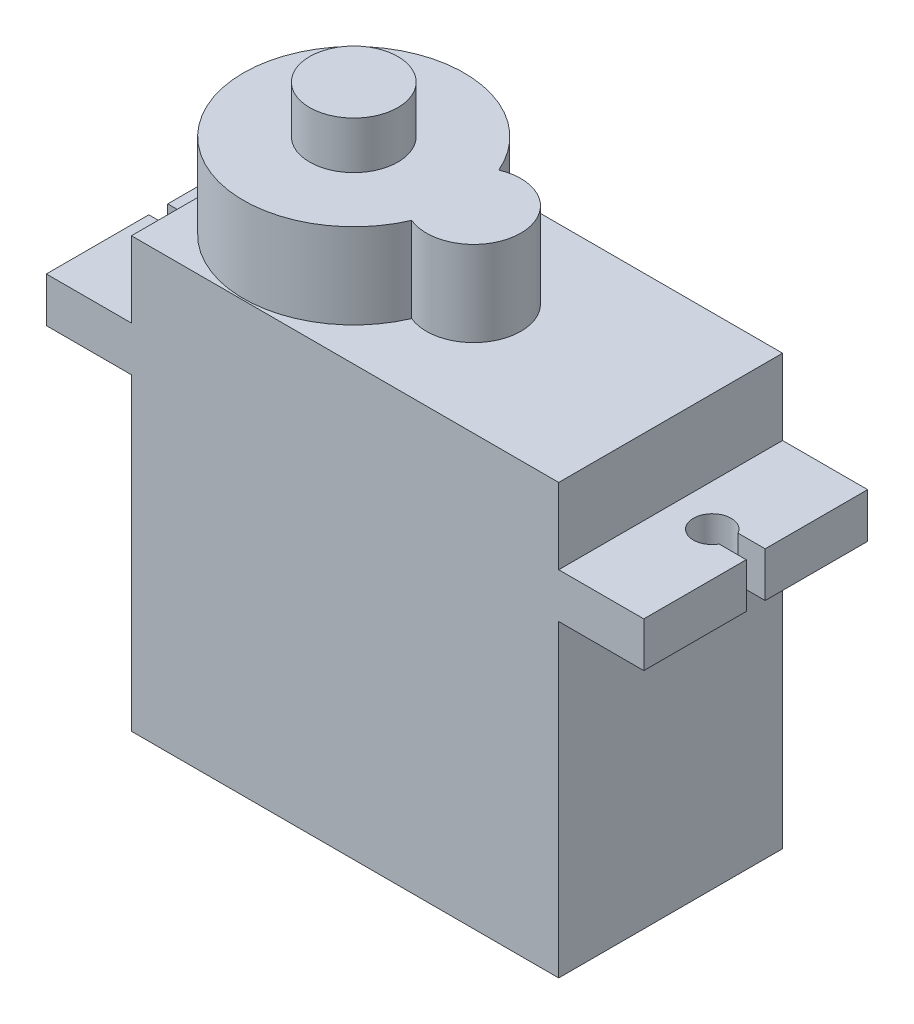
ISO-10303-21;
HEADER;
FILE_DESCRIPTION(('STEP AP214'),'2;1');
FILE_NAME('part.step','',(''),(''),'','','');
FILE_SCHEMA(('AUTOMOTIVE_DESIGN { 1 0 10303 214 1 1 1 1 }'));
ENDSEC;
DATA;
#1=APPLICATION_CONTEXT('core data for automotive mechanical design processes');
#2=APPLICATION_PROTOCOL_DEFINITION('international standard','automotive_design',2000,#1);
#3=PRODUCT_CONTEXT('',#1,'mechanical');
#4=PRODUCT('Part','Part','',(#3));
#5=PRODUCT_RELATED_PRODUCT_CATEGORY('part','',(#4));
#6=PRODUCT_DEFINITION_FORMATION('','',#4);
#7=PRODUCT_DEFINITION_CONTEXT('part definition',#1,'design');
#8=PRODUCT_DEFINITION('design','',#6,#7);
#9=PRODUCT_DEFINITION_SHAPE('','',#8);
#10=(LENGTH_UNIT() NAMED_UNIT(*) SI_UNIT(.MILLI.,.METRE.));
#11=(NAMED_UNIT(*) PLANE_ANGLE_UNIT() SI_UNIT($,.RADIAN.));
#12=(NAMED_UNIT(*) SI_UNIT($,.STERADIAN.) SOLID_ANGLE_UNIT());
#13=UNCERTAINTY_MEASURE_WITH_UNIT(LENGTH_MEASURE(1.E-05),#10,'distance_accuracy_value','');
#14=(GEOMETRIC_REPRESENTATION_CONTEXT(3) GLOBAL_UNCERTAINTY_ASSIGNED_CONTEXT((#13)) GLOBAL_UNIT_ASSIGNED_CONTEXT((#10,
#11,#12)) REPRESENTATION_CONTEXT('',''));
#15=CARTESIAN_POINT('',(0.,0.,0.));
#16=DIRECTION('',(0.,0.,1.));
#17=DIRECTION('',(1.,0.,0.));
#18=AXIS2_PLACEMENT_3D('',#15,#16,#17);
#19=CARTESIAN_POINT('',(-50.695532413833,0.,0.));
#20=DIRECTION('',(-1.,0.,0.));
#21=DIRECTION('',(0.,0.,1.));
#22=AXIS2_PLACEMENT_3D('',#19,#20,#21);
#23=PLANE('',#22);
#24=DIRECTION('',(0.,0.,-1.));
#25=VECTOR('',#24,1.);
#26=CARTESIAN_POINT('',(-50.695532413833,16.33,0.));
#27=LINE('',#26,#25);
#28=CARTESIAN_POINT('',(-50.695532413833,16.33,0.836861805785775));
#29=VERTEX_POINT('',#28);
#30=CARTESIAN_POINT('',(-50.695532413833,16.33,-4.58313819421423));
#31=VERTEX_POINT('',#30);
#32=EDGE_CURVE('E253',#29,#31,#27,.T.);
#33=ORIENTED_EDGE('',*,*,#32,.F.);
#34=DIRECTION('',(0.,1.,0.));
#35=VECTOR('',#34,1.);
#36=CARTESIAN_POINT('',(-50.695532413833,0.,0.836861805785775));
#37=LINE('',#36,#35);
#38=CARTESIAN_POINT('',(-50.695532413833,18.7,0.836861805785775));
#39=VERTEX_POINT('',#38);
#40=EDGE_CURVE('E46',#29,#39,#37,.T.);
#41=ORIENTED_EDGE('',*,*,#40,.T.);
#42=DIRECTION('',(0.,0.,-1.));
#43=VECTOR('',#42,1.);
#44=CARTESIAN_POINT('',(-50.695532413833,18.7,0.));
#45=LINE('',#44,#43);
#46=CARTESIAN_POINT('',(-50.695532413833,18.7,-4.58313819421423));
#47=VERTEX_POINT('',#46);
#48=EDGE_CURVE('E255',#39,#47,#45,.T.);
#49=ORIENTED_EDGE('',*,*,#48,.T.);
#50=DIRECTION('',(0.,-1.,0.));
#51=VECTOR('',#50,1.);
#52=CARTESIAN_POINT('',(-50.695532413833,0.,-4.58313819421423));
#53=LINE('',#52,#51);
#54=EDGE_CURVE('E259',#47,#31,#53,.T.);
#55=ORIENTED_EDGE('',*,*,#54,.T.);
#56=EDGE_LOOP('',(#33,#41,#49,#55));
#57=FACE_BOUND('',#56,.T.);
#58=ADVANCED_FACE('F38',(#57),#23,.T.);
#59=CARTESIAN_POINT('',(-46.195532413833,22.7,-4.58313819421423));
#60=DIRECTION('',(1.,0.,0.));
#61=DIRECTION('',(0.,0.,-1.));
#62=AXIS2_PLACEMENT_3D('',#59,#60,#61);
#63=PLANE('',#62);
#64=DIRECTION('',(0.,0.,-1.));
#65=VECTOR('',#64,1.);
#66=CARTESIAN_POINT('',(-46.195532413833,18.7,0.));
#67=LINE('',#66,#65);
#68=CARTESIAN_POINT('',(-46.195532413833,18.7,7.25686180578577));
#69=VERTEX_POINT('',#68);
#70=CARTESIAN_POINT('',(-46.195532413833,18.7,-4.58313819421423));
#71=VERTEX_POINT('',#70);
#72=EDGE_CURVE('E264',#69,#71,#67,.T.);
#73=ORIENTED_EDGE('',*,*,#72,.F.);
#74=DIRECTION('',(0.,-1.,0.));
#75=VECTOR('',#74,1.);
#76=CARTESIAN_POINT('',(-46.195532413833,22.7,7.25686180578577));
#77=LINE('',#76,#75);
#78=CARTESIAN_POINT('',(-46.195532413833,22.7,7.25686180578577));
#79=VERTEX_POINT('',#78);
#80=EDGE_CURVE('E350',#79,#69,#77,.T.);
#81=ORIENTED_EDGE('',*,*,#80,.F.);
#82=DIRECTION('',(0.,0.,1.));
#83=VECTOR('',#82,1.);
#84=CARTESIAN_POINT('',(-46.195532413833,22.7,-4.58313819421423));
#85=LINE('',#84,#83);
#86=CARTESIAN_POINT('',(-46.195532413833,22.7,1.33686180578577));
#87=VERTEX_POINT('',#86);
#88=EDGE_CURVE('E693',#87,#79,#85,.T.);
#89=ORIENTED_EDGE('',*,*,#88,.F.);
#90=CARTESIAN_POINT('',(-46.195532413833,22.7,-4.58313819421423));
#91=VERTEX_POINT('',#90);
#92=EDGE_CURVE('E723',#91,#87,#85,.T.);
#93=ORIENTED_EDGE('',*,*,#92,.F.);
#94=DIRECTION('',(0.,-1.,0.));
#95=VECTOR('',#94,1.);
#96=CARTESIAN_POINT('',(-46.195532413833,22.7,-4.58313819421423));
#97=LINE('',#96,#95);
#98=EDGE_CURVE('E694',#91,#71,#97,.T.);
#99=ORIENTED_EDGE('',*,*,#98,.T.);
#100=EDGE_LOOP('',(#73,#81,#89,#93,#99));
#101=FACE_BOUND('',#100,.T.);
#102=ADVANCED_FACE('F379',(#101),#63,.F.);
#103=CARTESIAN_POINT('',(-19.095532413833,16.33,0.));
#104=DIRECTION('',(0.,1.,0.));
#105=DIRECTION('',(0.,0.,1.));
#106=AXIS2_PLACEMENT_3D('',#103,#104,#105);
#107=PLANE('',#106);
#108=DIRECTION('',(-1.,0.,0.));
#109=VECTOR('',#108,1.);
#110=CARTESIAN_POINT('',(-19.095532413833,16.33,1.83686180578577));
#111=LINE('',#110,#109);
#112=CARTESIAN_POINT('',(-19.095532413833,16.33,1.83686180578577));
#113=VERTEX_POINT('',#112);
#114=CARTESIAN_POINT('',(-20.5295070100486,16.33,1.83686180578577));
#115=VERTEX_POINT('',#114);
#116=EDGE_CURVE('E293',#113,#115,#111,.T.);
#117=ORIENTED_EDGE('',*,*,#116,.F.);
#118=DIRECTION('',(0.,0.,-1.));
#119=VECTOR('',#118,1.);
#120=CARTESIAN_POINT('',(-19.095532413833,16.33,0.));
#121=LINE('',#120,#119);
#122=CARTESIAN_POINT('',(-19.095532413833,16.33,7.25686180578577));
#123=VERTEX_POINT('',#122);
#124=EDGE_CURVE('E304',#123,#113,#121,.T.);
#125=ORIENTED_EDGE('',*,*,#124,.F.);
#126=DIRECTION('',(-1.,0.,0.));
#127=VECTOR('',#126,1.);
#128=CARTESIAN_POINT('',(-19.095532413833,16.33,7.25686180578577));
#129=LINE('',#128,#127);
#130=CARTESIAN_POINT('',(-23.595532413833,16.33,7.25686180578577));
#131=VERTEX_POINT('',#130);
#132=EDGE_CURVE('E329',#123,#131,#129,.T.);
#133=ORIENTED_EDGE('',*,*,#132,.T.);
#134=DIRECTION('',(0.,0.,-1.));
#135=VECTOR('',#134,1.);
#136=CARTESIAN_POINT('',(-23.595532413833,16.33,0.));
#137=LINE('',#136,#135);
#138=CARTESIAN_POINT('',(-23.595532413833,16.33,-4.58313819421423));
#139=VERTEX_POINT('',#138);
#140=EDGE_CURVE('E298',#131,#139,#137,.T.);
#141=ORIENTED_EDGE('',*,*,#140,.T.);
#142=DIRECTION('',(-1.,0.,0.));
#143=VECTOR('',#142,1.);
#144=CARTESIAN_POINT('',(-19.095532413833,16.33,-4.58313819421423));
#145=LINE('',#144,#143);
#146=CARTESIAN_POINT('',(-19.095532413833,16.33,-4.58313819421423));
#147=VERTEX_POINT('',#146);
#148=EDGE_CURVE('E326',#147,#139,#145,.T.);
#149=ORIENTED_EDGE('',*,*,#148,.F.);
#150=CARTESIAN_POINT('',(-19.095532413833,16.33,0.836861805785775));
#151=VERTEX_POINT('',#150);
#152=EDGE_CURVE('E302',#151,#147,#121,.T.);
#153=ORIENTED_EDGE('',*,*,#152,.F.);
#154=DIRECTION('',(-1.,0.,0.));
#155=VECTOR('',#154,1.);
#156=CARTESIAN_POINT('',(-19.095532413833,16.33,0.836861805785775));
#157=LINE('',#156,#155);
#158=CARTESIAN_POINT('',(-20.5295070100486,16.33,0.836861805785775));
#159=VERTEX_POINT('',#158);
#160=EDGE_CURVE('E289',#151,#159,#157,.T.);
#161=ORIENTED_EDGE('',*,*,#160,.T.);
#162=CARTESIAN_POINT('',(-21.395532413833,16.33,1.33686180578577));
#163=DIRECTION('',(0.,1.,0.));
#164=DIRECTION('',(0.,0.,1.));
#165=AXIS2_PLACEMENT_3D('',#162,#163,#164);
#166=CIRCLE('',#165,1.);
#167=EDGE_CURVE('E295',#159,#115,#166,.T.);
#168=ORIENTED_EDGE('',*,*,#167,.T.);
#169=EDGE_LOOP('',(#117,#125,#133,#141,#149,#153,#161,#168));
#170=FACE_BOUND('',#169,.T.);
#171=ADVANCED_FACE('F385',(#170),#107,.F.);
#172=CARTESIAN_POINT('',(-19.095532413833,18.7,0.));
#173=DIRECTION('',(0.,1.,0.));
#174=DIRECTION('',(0.,0.,1.));
#175=AXIS2_PLACEMENT_3D('',#172,#173,#174);
#176=PLANE('',#175);
#177=DIRECTION('',(0.,0.,-1.));
#178=VECTOR('',#177,1.);
#179=CARTESIAN_POINT('',(-19.095532413833,18.7,0.));
#180=LINE('',#179,#178);
#181=CARTESIAN_POINT('',(-19.095532413833,18.7,7.25686180578577));
#182=VERTEX_POINT('',#181);
#183=CARTESIAN_POINT('',(-19.095532413833,18.7,1.83686180578577));
#184=VERTEX_POINT('',#183);
#185=EDGE_CURVE('E311',#182,#184,#180,.T.);
#186=ORIENTED_EDGE('',*,*,#185,.T.);
#187=DIRECTION('',(-1.,0.,0.));
#188=VECTOR('',#187,1.);
#189=CARTESIAN_POINT('',(0.,18.7,1.83686180578577));
#190=LINE('',#189,#188);
#191=CARTESIAN_POINT('',(-20.5295070100486,18.7,1.83686180578577));
#192=VERTEX_POINT('',#191);
#193=EDGE_CURVE('E283',#184,#192,#190,.T.);
#194=ORIENTED_EDGE('',*,*,#193,.T.);
#195=CARTESIAN_POINT('',(-21.395532413833,18.7,1.33686180578577));
#196=DIRECTION('',(0.,1.,0.));
#197=DIRECTION('',(0.,0.,1.));
#198=AXIS2_PLACEMENT_3D('',#195,#196,#197);
#199=CIRCLE('',#198,1.);
#200=CARTESIAN_POINT('',(-20.5295070100486,18.7,0.836861805785775));
#201=VERTEX_POINT('',#200);
#202=EDGE_CURVE('E280',#201,#192,#199,.T.);
#203=ORIENTED_EDGE('',*,*,#202,.F.);
#204=DIRECTION('',(-1.,0.,0.));
#205=VECTOR('',#204,1.);
#206=CARTESIAN_POINT('',(0.,18.7,0.836861805785775));
#207=LINE('',#206,#205);
#208=CARTESIAN_POINT('',(-19.095532413833,18.7,0.836861805785775));
#209=VERTEX_POINT('',#208);
#210=EDGE_CURVE('E277',#209,#201,#207,.T.);
#211=ORIENTED_EDGE('',*,*,#210,.F.);
#212=CARTESIAN_POINT('',(-19.095532413833,18.7,-4.58313819421423));
#213=VERTEX_POINT('',#212);
#214=EDGE_CURVE('E310',#209,#213,#180,.T.);
#215=ORIENTED_EDGE('',*,*,#214,.T.);
#216=DIRECTION('',(-1.,0.,0.));
#217=VECTOR('',#216,1.);
#218=CARTESIAN_POINT('',(-19.095532413833,18.7,-4.58313819421423));
#219=LINE('',#218,#217);
#220=CARTESIAN_POINT('',(-23.595532413833,18.7,-4.58313819421423));
#221=VERTEX_POINT('',#220);
#222=EDGE_CURVE('E330',#213,#221,#219,.T.);
#223=ORIENTED_EDGE('',*,*,#222,.T.);
#224=DIRECTION('',(0.,0.,-1.));
#225=VECTOR('',#224,1.);
#226=CARTESIAN_POINT('',(-23.595532413833,18.7,0.));
#227=LINE('',#226,#225);
#228=CARTESIAN_POINT('',(-23.595532413833,18.7,7.25686180578577));
#229=VERTEX_POINT('',#228);
#230=EDGE_CURVE('E303',#229,#221,#227,.T.);
#231=ORIENTED_EDGE('',*,*,#230,.F.);
#232=DIRECTION('',(-1.,0.,0.));
#233=VECTOR('',#232,1.);
#234=CARTESIAN_POINT('',(-19.095532413833,18.7,7.25686180578577));
#235=LINE('',#234,#233);
#236=EDGE_CURVE('E314',#182,#229,#235,.T.);
#237=ORIENTED_EDGE('',*,*,#236,.F.);
#238=EDGE_LOOP('',(#186,#194,#203,#211,#215,#223,#231,#237));
#239=FACE_BOUND('',#238,.T.);
#240=ADVANCED_FACE('F551',(#239),#176,.T.);
#241=CARTESIAN_POINT('',(-19.095532413833,0.,0.));
#242=DIRECTION('',(1.,0.,0.));
#243=DIRECTION('',(0.,0.,-1.));
#244=AXIS2_PLACEMENT_3D('',#241,#242,#243);
#245=PLANE('',#244);
#246=ORIENTED_EDGE('',*,*,#124,.T.);
#247=DIRECTION('',(0.,1.,0.));
#248=VECTOR('',#247,1.);
#249=CARTESIAN_POINT('',(-19.095532413833,0.,1.83686180578577));
#250=LINE('',#249,#248);
#251=EDGE_CURVE('E349',#113,#184,#250,.T.);
#252=ORIENTED_EDGE('',*,*,#251,.T.);
#253=ORIENTED_EDGE('',*,*,#185,.F.);
#254=DIRECTION('',(0.,-1.,0.));
#255=VECTOR('',#254,1.);
#256=CARTESIAN_POINT('',(-19.095532413833,0.,7.25686180578577));
#257=LINE('',#256,#255);
#258=EDGE_CURVE('E299',#182,#123,#257,.T.);
#259=ORIENTED_EDGE('',*,*,#258,.T.);
#260=EDGE_LOOP('',(#246,#252,#253,#259));
#261=FACE_BOUND('',#260,.T.);
#262=ADVANCED_FACE('F541',(#261),#245,.T.);
#263=CARTESIAN_POINT('',(-23.595532413833,22.7,-4.58313819421423));
#264=DIRECTION('',(-1.,0.,0.));
#265=DIRECTION('',(0.,0.,1.));
#266=AXIS2_PLACEMENT_3D('',#263,#264,#265);
#267=PLANE('',#266);
#268=ORIENTED_EDGE('',*,*,#140,.F.);
#269=DIRECTION('',(0.,-1.,0.));
#270=VECTOR('',#269,1.);
#271=CARTESIAN_POINT('',(-23.595532413833,22.7,7.25686180578577));
#272=LINE('',#271,#270);
#273=CARTESIAN_POINT('',(-23.595532413833,0.,7.25686180578577));
#274=VERTEX_POINT('',#273);
#275=EDGE_CURVE('E323',#131,#274,#272,.T.);
#276=ORIENTED_EDGE('',*,*,#275,.T.);
#277=DIRECTION('',(0.,0.,-1.));
#278=VECTOR('',#277,1.);
#279=CARTESIAN_POINT('',(-23.595532413833,0.,-4.58313819421423));
#280=LINE('',#279,#278);
#281=CARTESIAN_POINT('',(-23.595532413833,0.,-4.58313819421423));
#282=VERTEX_POINT('',#281);
#283=EDGE_CURVE('E681',#274,#282,#280,.T.);
#284=ORIENTED_EDGE('',*,*,#283,.T.);
#285=DIRECTION('',(0.,-1.,0.));
#286=VECTOR('',#285,1.);
#287=CARTESIAN_POINT('',(-23.595532413833,22.7,-4.58313819421423));
#288=LINE('',#287,#286);
#289=EDGE_CURVE('E696',#139,#282,#288,.T.);
#290=ORIENTED_EDGE('',*,*,#289,.F.);
#291=EDGE_LOOP('',(#268,#276,#284,#290));
#292=FACE_BOUND('',#291,.T.);
#293=ADVANCED_FACE('F550',(#292),#267,.F.);
#294=CARTESIAN_POINT('',(-46.195532413833,22.7,7.25686180578577));
#295=DIRECTION('',(0.,1.,0.));
#296=DIRECTION('',(0.,0.,1.));
#297=AXIS2_PLACEMENT_3D('',#294,#295,#296);
#298=PLANE('',#297);
#299=CARTESIAN_POINT('',(-40.355532413833,22.7,1.33686180578577));
#300=DIRECTION('',(0.,1.,0.));
#301=DIRECTION('',(0.,0.,1.));
#302=AXIS2_PLACEMENT_3D('',#299,#300,#301);
#303=CIRCLE('',#302,5.84);
#304=CARTESIAN_POINT('',(-34.9887185337068,22.7,-0.965942739998552));
#305=VERTEX_POINT('',#304);
#306=EDGE_CURVE('E728',#305,#87,#303,.T.);
#307=ORIENTED_EDGE('',*,*,#306,.F.);
#308=CARTESIAN_POINT('',(-34.015532413833,22.7,1.33686180578577));
#309=DIRECTION('',(0.,1.,0.));
#310=DIRECTION('',(0.,0.,1.));
#311=AXIS2_PLACEMENT_3D('',#308,#309,#310);
#312=CIRCLE('',#311,2.5);
#313=CARTESIAN_POINT('',(-34.9887185337068,22.7,3.6396663515701));
#314=VERTEX_POINT('',#313);
#315=EDGE_CURVE('E335',#314,#305,#312,.T.);
#316=ORIENTED_EDGE('',*,*,#315,.F.);
#317=EDGE_CURVE('E684',#87,#314,#303,.T.);
#318=ORIENTED_EDGE('',*,*,#317,.F.);
#319=ORIENTED_EDGE('',*,*,#88,.T.);
#320=DIRECTION('',(1.,0.,0.));
#321=VECTOR('',#320,1.);
#322=CARTESIAN_POINT('',(-46.195532413833,22.7,7.25686180578577));
#323=LINE('',#322,#321);
#324=CARTESIAN_POINT('',(-23.595532413833,22.7,7.25686180578577));
#325=VERTEX_POINT('',#324);
#326=EDGE_CURVE('E722',#79,#325,#323,.T.);
#327=ORIENTED_EDGE('',*,*,#326,.T.);
#328=DIRECTION('',(0.,0.,-1.));
#329=VECTOR('',#328,1.);
#330=CARTESIAN_POINT('',(-23.595532413833,22.7,-4.58313819421423));
#331=LINE('',#330,#329);
#332=CARTESIAN_POINT('',(-23.595532413833,22.7,-4.58313819421423));
#333=VERTEX_POINT('',#332);
#334=EDGE_CURVE('E721',#325,#333,#331,.T.);
#335=ORIENTED_EDGE('',*,*,#334,.T.);
#336=DIRECTION('',(-1.,0.,0.));
#337=VECTOR('',#336,1.);
#338=CARTESIAN_POINT('',(-46.195532413833,22.7,-4.58313819421423));
#339=LINE('',#338,#337);
#340=EDGE_CURVE('E687',#333,#91,#339,.T.);
#341=ORIENTED_EDGE('',*,*,#340,.T.);
#342=ORIENTED_EDGE('',*,*,#92,.T.);
#343=EDGE_LOOP('',(#307,#316,#318,#319,#327,#335,#341,#342));
#344=FACE_BOUND('',#343,.T.);
#345=ADVANCED_FACE('F585',(#344),#298,.T.);
#346=CARTESIAN_POINT('',(-40.355532413833,27.2,1.33686180578577));
#347=DIRECTION('',(0.,-1.,0.));
#348=DIRECTION('',(0.,0.,-1.));
#349=AXIS2_PLACEMENT_3D('',#346,#347,#348);
#350=CYLINDRICAL_SURFACE('',#349,5.84);
#351=DIRECTION('',(0.,-1.,0.));
#352=VECTOR('',#351,1.);
#353=CARTESIAN_POINT('',(-34.9887185337068,27.2,3.6396663515701));
#354=LINE('',#353,#352);
#355=CARTESIAN_POINT('',(-34.9887185337068,27.2,3.6396663515701));
#356=VERTEX_POINT('',#355);
#357=EDGE_CURVE('E734',#356,#314,#354,.T.);
#358=ORIENTED_EDGE('',*,*,#357,.F.);
#359=CARTESIAN_POINT('',(-40.355532413833,27.2,1.33686180578577));
#360=DIRECTION('',(0.,1.,0.));
#361=DIRECTION('',(0.,0.,1.));
#362=AXIS2_PLACEMENT_3D('',#359,#360,#361);
#363=CIRCLE('',#362,5.84);
#364=CARTESIAN_POINT('',(-34.9887185337068,27.2,-0.965942739998555));
#365=VERTEX_POINT('',#364);
#366=EDGE_CURVE('E679',#365,#356,#363,.T.);
#367=ORIENTED_EDGE('',*,*,#366,.F.);
#368=DIRECTION('',(0.,-1.,0.));
#369=VECTOR('',#368,1.);
#370=CARTESIAN_POINT('',(-34.9887185337068,27.2,-0.965942739998552));
#371=LINE('',#370,#369);
#372=EDGE_CURVE('E738',#365,#305,#371,.T.);
#373=ORIENTED_EDGE('',*,*,#372,.T.);
#374=ORIENTED_EDGE('',*,*,#306,.T.);
#375=ORIENTED_EDGE('',*,*,#317,.T.);
#376=EDGE_LOOP('',(#358,#367,#373,#374,#375));
#377=FACE_BOUND('',#376,.T.);
#378=ADVANCED_FACE('F605',(#377),#350,.T.);
#379=CARTESIAN_POINT('',(0.,27.2,0.));
#380=DIRECTION('',(0.,1.,0.));
#381=DIRECTION('',(0.,0.,1.));
#382=AXIS2_PLACEMENT_3D('',#379,#380,#381);
#383=PLANE('',#382);
#384=ORIENTED_EDGE('',*,*,#366,.T.);
#385=CARTESIAN_POINT('',(-34.015532413833,27.2,1.33686180578577));
#386=DIRECTION('',(0.,1.,0.));
#387=DIRECTION('',(0.,0.,1.));
#388=AXIS2_PLACEMENT_3D('',#385,#386,#387);
#389=CIRCLE('',#388,2.5);
#390=EDGE_CURVE('E741',#356,#365,#389,.T.);
#391=ORIENTED_EDGE('',*,*,#390,.T.);
#392=EDGE_LOOP('',(#384,#391));
#393=FACE_BOUND('',#392,.T.);
#394=CARTESIAN_POINT('',(-40.355532413833,27.2,1.33686180578577));
#395=DIRECTION('',(0.,1.,0.));
#396=DIRECTION('',(0.,0.,1.));
#397=AXIS2_PLACEMENT_3D('',#394,#395,#396);
#398=CIRCLE('',#397,2.335);
#399=CARTESIAN_POINT('',(-40.355532413833,27.2,3.67186180578577));
#400=VERTEX_POINT('',#399);
#401=EDGE_CURVE('E730',#400,#400,#398,.T.);
#402=ORIENTED_EDGE('',*,*,#401,.F.);
#403=EDGE_LOOP('',(#402));
#404=FACE_BOUND('',#403,.T.);
#405=ADVANCED_FACE('F492',(#393,#404),#383,.T.);
#406=CARTESIAN_POINT('',(-46.195532413833,16.33,7.25686180578577));
#407=VERTEX_POINT('',#406);
#408=CARTESIAN_POINT('',(-46.195532413833,0.,7.25686180578577));
#409=VERTEX_POINT('',#408);
#410=EDGE_CURVE('E61',#407,#409,#77,.T.);
#411=ORIENTED_EDGE('',*,*,#410,.F.);
#412=DIRECTION('',(0.,0.,-1.));
#413=VECTOR('',#412,1.);
#414=CARTESIAN_POINT('',(-46.195532413833,16.33,0.));
#415=LINE('',#414,#413);
#416=CARTESIAN_POINT('',(-46.195532413833,16.33,-4.58313819421423));
#417=VERTEX_POINT('',#416);
#418=EDGE_CURVE('E248',#407,#417,#415,.T.);
#419=ORIENTED_EDGE('',*,*,#418,.T.);
#420=CARTESIAN_POINT('',(-46.195532413833,0.,-4.58313819421423));
#421=VERTEX_POINT('',#420);
#422=EDGE_CURVE('E361',#417,#421,#97,.T.);
#423=ORIENTED_EDGE('',*,*,#422,.T.);
#424=DIRECTION('',(0.,0.,1.));
#425=VECTOR('',#424,1.);
#426=CARTESIAN_POINT('',(-46.195532413833,0.,-4.58313819421423));
#427=LINE('',#426,#425);
#428=EDGE_CURVE('E675',#421,#409,#427,.T.);
#429=ORIENTED_EDGE('',*,*,#428,.T.);
#430=EDGE_LOOP('',(#411,#419,#423,#429));
#431=FACE_BOUND('',#430,.T.);
#432=ADVANCED_FACE('F40',(#431),#63,.F.);
#433=CARTESIAN_POINT('',(-46.195532413833,22.7,7.25686180578577));
#434=DIRECTION('',(0.,0.,-1.));
#435=DIRECTION('',(-1.,0.,0.));
#436=AXIS2_PLACEMENT_3D('',#433,#434,#435);
#437=PLANE('',#436);
#438=DIRECTION('',(1.,0.,0.));
#439=VECTOR('',#438,1.);
#440=CARTESIAN_POINT('',(-46.195532413833,0.,7.25686180578577));
#441=LINE('',#440,#439);
#442=EDGE_CURVE('E678',#409,#274,#441,.T.);
#443=ORIENTED_EDGE('',*,*,#442,.T.);
#444=ORIENTED_EDGE('',*,*,#275,.F.);
#445=ORIENTED_EDGE('',*,*,#132,.F.);
#446=ORIENTED_EDGE('',*,*,#258,.F.);
#447=ORIENTED_EDGE('',*,*,#236,.T.);
#448=EDGE_CURVE('E705',#325,#229,#272,.T.);
#449=ORIENTED_EDGE('',*,*,#448,.F.);
#450=ORIENTED_EDGE('',*,*,#326,.F.);
#451=ORIENTED_EDGE('',*,*,#80,.T.);
#452=DIRECTION('',(1.,0.,0.));
#453=VECTOR('',#452,1.);
#454=CARTESIAN_POINT('',(-50.695532413833,18.7,7.25686180578577));
#455=LINE('',#454,#453);
#456=CARTESIAN_POINT('',(-50.695532413833,18.7,7.25686180578577));
#457=VERTEX_POINT('',#456);
#458=EDGE_CURVE('E272',#457,#69,#455,.T.);
#459=ORIENTED_EDGE('',*,*,#458,.F.);
#460=DIRECTION('',(0.,1.,0.));
#461=VECTOR('',#460,1.);
#462=CARTESIAN_POINT('',(-50.695532413833,0.,7.25686180578577));
#463=LINE('',#462,#461);
#464=CARTESIAN_POINT('',(-50.695532413833,16.33,7.25686180578577));
#465=VERTEX_POINT('',#464);
#466=EDGE_CURVE('E252',#465,#457,#463,.T.);
#467=ORIENTED_EDGE('',*,*,#466,.F.);
#468=DIRECTION('',(1.,0.,0.));
#469=VECTOR('',#468,1.);
#470=CARTESIAN_POINT('',(-50.695532413833,16.33,7.25686180578577));
#471=LINE('',#470,#469);
#472=EDGE_CURVE('E275',#465,#407,#471,.T.);
#473=ORIENTED_EDGE('',*,*,#472,.T.);
#474=ORIENTED_EDGE('',*,*,#410,.T.);
#475=EDGE_LOOP('',(#443,#444,#445,#446,#447,#449,#450,#451,#459,#467,#473,#474));
#476=FACE_BOUND('',#475,.T.);
#477=ADVANCED_FACE('F403',(#476),#437,.F.);
#478=ORIENTED_EDGE('',*,*,#448,.T.);
#479=ORIENTED_EDGE('',*,*,#230,.T.);
#480=EDGE_CURVE('E703',#333,#221,#288,.T.);
#481=ORIENTED_EDGE('',*,*,#480,.F.);
#482=ORIENTED_EDGE('',*,*,#334,.F.);
#483=EDGE_LOOP('',(#478,#479,#481,#482));
#484=FACE_BOUND('',#483,.T.);
#485=ADVANCED_FACE('F468',(#484),#267,.F.);
#486=CARTESIAN_POINT('',(-46.195532413833,22.7,-4.58313819421423));
#487=DIRECTION('',(0.,0.,1.));
#488=DIRECTION('',(1.,0.,0.));
#489=AXIS2_PLACEMENT_3D('',#486,#487,#488);
#490=PLANE('',#489);
#491=DIRECTION('',(-1.,0.,0.));
#492=VECTOR('',#491,1.);
#493=CARTESIAN_POINT('',(-46.195532413833,0.,-4.58313819421423));
#494=LINE('',#493,#492);
#495=EDGE_CURVE('E677',#282,#421,#494,.T.);
#496=ORIENTED_EDGE('',*,*,#495,.T.);
#497=ORIENTED_EDGE('',*,*,#422,.F.);
#498=DIRECTION('',(1.,0.,0.));
#499=VECTOR('',#498,1.);
#500=CARTESIAN_POINT('',(-50.695532413833,16.33,-4.58313819421423));
#501=LINE('',#500,#499);
#502=EDGE_CURVE('E262',#31,#417,#501,.T.);
#503=ORIENTED_EDGE('',*,*,#502,.F.);
#504=ORIENTED_EDGE('',*,*,#54,.F.);
#505=DIRECTION('',(1.,0.,0.));
#506=VECTOR('',#505,1.);
#507=CARTESIAN_POINT('',(-50.695532413833,18.7,-4.58313819421423));
#508=LINE('',#507,#506);
#509=EDGE_CURVE('E269',#47,#71,#508,.T.);
#510=ORIENTED_EDGE('',*,*,#509,.T.);
#511=ORIENTED_EDGE('',*,*,#98,.F.);
#512=ORIENTED_EDGE('',*,*,#340,.F.);
#513=ORIENTED_EDGE('',*,*,#480,.T.);
#514=ORIENTED_EDGE('',*,*,#222,.F.);
#515=DIRECTION('',(0.,1.,0.));
#516=VECTOR('',#515,1.);
#517=CARTESIAN_POINT('',(-19.095532413833,0.,-4.58313819421423));
#518=LINE('',#517,#516);
#519=EDGE_CURVE('E307',#147,#213,#518,.T.);
#520=ORIENTED_EDGE('',*,*,#519,.F.);
#521=ORIENTED_EDGE('',*,*,#148,.T.);
#522=ORIENTED_EDGE('',*,*,#289,.T.);
#523=EDGE_LOOP('',(#496,#497,#503,#504,#510,#511,#512,#513,#514,#520,#521,#522));
#524=FACE_BOUND('',#523,.T.);
#525=ADVANCED_FACE('F360',(#524),#490,.F.);
#526=CARTESIAN_POINT('',(-46.195532413833,0.,7.25686180578577));
#527=DIRECTION('',(0.,1.,0.));
#528=DIRECTION('',(0.,0.,1.));
#529=AXIS2_PLACEMENT_3D('',#526,#527,#528);
#530=PLANE('',#529);
#531=ORIENTED_EDGE('',*,*,#428,.F.);
#532=ORIENTED_EDGE('',*,*,#495,.F.);
#533=ORIENTED_EDGE('',*,*,#283,.F.);
#534=ORIENTED_EDGE('',*,*,#442,.F.);
#535=EDGE_LOOP('',(#531,#532,#533,#534));
#536=FACE_BOUND('',#535,.T.);
#537=ADVANCED_FACE('F467',(#536),#530,.F.);
#538=CARTESIAN_POINT('',(-40.355532413833,29.7,1.33686180578577));
#539=DIRECTION('',(0.,-1.,0.));
#540=DIRECTION('',(0.,0.,-1.));
#541=AXIS2_PLACEMENT_3D('',#538,#539,#540);
#542=CYLINDRICAL_SURFACE('',#541,2.335);
#543=CARTESIAN_POINT('',(-40.355532413833,29.7,1.33686180578577));
#544=DIRECTION('',(0.,1.,0.));
#545=DIRECTION('',(0.,0.,1.));
#546=AXIS2_PLACEMENT_3D('',#543,#544,#545);
#547=CIRCLE('',#546,2.335);
#548=CARTESIAN_POINT('',(-40.355532413833,29.7,3.67186180578577));
#549=VERTEX_POINT('',#548);
#550=EDGE_CURVE('E733',#549,#549,#547,.T.);
#551=ORIENTED_EDGE('',*,*,#550,.F.);
#552=EDGE_LOOP('',(#551));
#553=FACE_BOUND('',#552,.T.);
#554=ORIENTED_EDGE('',*,*,#401,.T.);
#555=EDGE_LOOP('',(#554));
#556=FACE_BOUND('',#555,.T.);
#557=ADVANCED_FACE('F633',(#553,#556),#542,.T.);
#558=CARTESIAN_POINT('',(-40.355532413833,29.7,1.33686180578577));
#559=DIRECTION('',(0.,1.,0.));
#560=DIRECTION('',(0.,0.,1.));
#561=AXIS2_PLACEMENT_3D('',#558,#559,#560);
#562=PLANE('',#561);
#563=ORIENTED_EDGE('',*,*,#550,.T.);
#564=EDGE_LOOP('',(#563));
#565=FACE_BOUND('',#564,.T.);
#566=ADVANCED_FACE('F595',(#565),#562,.T.);
#567=CARTESIAN_POINT('',(-34.015532413833,27.2,1.33686180578577));
#568=DIRECTION('',(0.,-1.,0.));
#569=DIRECTION('',(0.,0.,-1.));
#570=AXIS2_PLACEMENT_3D('',#567,#568,#569);
#571=CYLINDRICAL_SURFACE('',#570,2.5);
#572=ORIENTED_EDGE('',*,*,#315,.T.);
#573=ORIENTED_EDGE('',*,*,#372,.F.);
#574=ORIENTED_EDGE('',*,*,#390,.F.);
#575=ORIENTED_EDGE('',*,*,#357,.T.);
#576=EDGE_LOOP('',(#572,#573,#574,#575));
#577=FACE_BOUND('',#576,.T.);
#578=ADVANCED_FACE('F538',(#577),#571,.T.);
#579=DIRECTION('',(0.,1.,0.));
#580=VECTOR('',#579,1.);
#581=CARTESIAN_POINT('',(-19.095532413833,0.,0.836861805785775));
#582=LINE('',#581,#580);
#583=EDGE_CURVE('E347',#151,#209,#582,.T.);
#584=ORIENTED_EDGE('',*,*,#583,.F.);
#585=ORIENTED_EDGE('',*,*,#152,.T.);
#586=ORIENTED_EDGE('',*,*,#519,.T.);
#587=ORIENTED_EDGE('',*,*,#214,.F.);
#588=EDGE_LOOP('',(#584,#585,#586,#587));
#589=FACE_BOUND('',#588,.T.);
#590=ADVANCED_FACE('F528',(#589),#245,.T.);
#591=CARTESIAN_POINT('',(-21.395532413833,-2.50000000007189E-05,1.33686180578577));
#592=DIRECTION('',(0.,1.,0.));
#593=DIRECTION('',(0.,0.,1.));
#594=AXIS2_PLACEMENT_3D('',#591,#592,#593);
#595=CYLINDRICAL_SURFACE('',#594,1.);
#596=DIRECTION('',(0.,1.,0.));
#597=VECTOR('',#596,1.);
#598=CARTESIAN_POINT('',(-20.5295070100486,-2.50000000007189E-05,0.836861805785775));
#599=LINE('',#598,#597);
#600=EDGE_CURVE('E286',#159,#201,#599,.T.);
#601=ORIENTED_EDGE('',*,*,#600,.T.);
#602=ORIENTED_EDGE('',*,*,#202,.T.);
#603=DIRECTION('',(0.,1.,0.));
#604=VECTOR('',#603,1.);
#605=CARTESIAN_POINT('',(-20.5295070100486,-2.50000000007189E-05,1.83686180578577));
#606=LINE('',#605,#604);
#607=EDGE_CURVE('E287',#115,#192,#606,.T.);
#608=ORIENTED_EDGE('',*,*,#607,.F.);
#609=ORIENTED_EDGE('',*,*,#167,.F.);
#610=EDGE_LOOP('',(#601,#602,#608,#609));
#611=FACE_BOUND('',#610,.T.);
#612=ADVANCED_FACE('F518',(#611),#595,.F.);
#613=CARTESIAN_POINT('',(0.,-2.50000000007189E-05,1.83686180578577));
#614=DIRECTION('',(0.,0.,-1.));
#615=DIRECTION('',(-1.,0.,0.));
#616=AXIS2_PLACEMENT_3D('',#613,#614,#615);
#617=PLANE('',#616);
#618=ORIENTED_EDGE('',*,*,#116,.T.);
#619=ORIENTED_EDGE('',*,*,#607,.T.);
#620=ORIENTED_EDGE('',*,*,#193,.F.);
#621=ORIENTED_EDGE('',*,*,#251,.F.);
#622=EDGE_LOOP('',(#618,#619,#620,#621));
#623=FACE_BOUND('',#622,.T.);
#624=ADVANCED_FACE('F508',(#623),#617,.T.);
#625=CARTESIAN_POINT('',(0.,-2.50000000007189E-05,0.836861805785775));
#626=DIRECTION('',(0.,0.,-1.));
#627=DIRECTION('',(-1.,0.,0.));
#628=AXIS2_PLACEMENT_3D('',#625,#626,#627);
#629=PLANE('',#628);
#630=ORIENTED_EDGE('',*,*,#583,.T.);
#631=ORIENTED_EDGE('',*,*,#210,.T.);
#632=ORIENTED_EDGE('',*,*,#600,.F.);
#633=ORIENTED_EDGE('',*,*,#160,.F.);
#634=EDGE_LOOP('',(#630,#631,#632,#633));
#635=FACE_BOUND('',#634,.T.);
#636=ADVANCED_FACE('F459',(#635),#629,.F.);
#637=CARTESIAN_POINT('',(-50.695532413833,16.33,0.));
#638=DIRECTION('',(0.,-1.,0.));
#639=DIRECTION('',(0.,0.,-1.));
#640=AXIS2_PLACEMENT_3D('',#637,#638,#639);
#641=PLANE('',#640);
#642=DIRECTION('',(-1.,0.,0.));
#643=VECTOR('',#642,1.);
#644=CARTESIAN_POINT('',(-50.695532413833,16.33,1.83686180578577));
#645=LINE('',#644,#643);
#646=CARTESIAN_POINT('',(-49.195532413833,16.33,1.83686180578577));
#647=VERTEX_POINT('',#646);
#648=CARTESIAN_POINT('',(-50.695532413833,16.33,1.83686180578577));
#649=VERTEX_POINT('',#648);
#650=EDGE_CURVE('E240',#647,#649,#645,.T.);
#651=ORIENTED_EDGE('',*,*,#650,.F.);
#652=DIRECTION('',(0.,0.,-1.));
#653=VECTOR('',#652,1.);
#654=CARTESIAN_POINT('',(-49.195532413833,16.33,0.));
#655=LINE('',#654,#653);
#656=CARTESIAN_POINT('',(-49.195532413833,16.33,1.77275170013984));
#657=VERTEX_POINT('',#656);
#658=EDGE_CURVE('E243',#647,#657,#655,.T.);
#659=ORIENTED_EDGE('',*,*,#658,.T.);
#660=CARTESIAN_POINT('',(-48.295532413833,16.33,1.33686180578577));
#661=DIRECTION('',(0.,-1.,0.));
#662=DIRECTION('',(0.,0.,-1.));
#663=AXIS2_PLACEMENT_3D('',#660,#661,#662);
#664=CIRCLE('',#663,0.999999999999998);
#665=CARTESIAN_POINT('',(-49.195532413833,16.33,0.900971911431708));
#666=VERTEX_POINT('',#665);
#667=EDGE_CURVE('E246',#666,#657,#664,.T.);
#668=ORIENTED_EDGE('',*,*,#667,.F.);
#669=DIRECTION('',(0.,0.,-1.));
#670=VECTOR('',#669,1.);
#671=CARTESIAN_POINT('',(-49.195532413833,16.33,0.));
#672=LINE('',#671,#670);
#673=CARTESIAN_POINT('',(-49.195532413833,16.33,0.836861805785774));
#674=VERTEX_POINT('',#673);
#675=EDGE_CURVE('E209',#666,#674,#672,.T.);
#676=ORIENTED_EDGE('',*,*,#675,.T.);
#677=DIRECTION('',(-1.,0.,0.));
#678=VECTOR('',#677,1.);
#679=CARTESIAN_POINT('',(-50.695532413833,16.33,0.836861805785775));
#680=LINE('',#679,#678);
#681=EDGE_CURVE('E234',#674,#29,#680,.T.);
#682=ORIENTED_EDGE('',*,*,#681,.T.);
#683=ORIENTED_EDGE('',*,*,#32,.T.);
#684=ORIENTED_EDGE('',*,*,#502,.T.);
#685=ORIENTED_EDGE('',*,*,#418,.F.);
#686=ORIENTED_EDGE('',*,*,#472,.F.);
#687=EDGE_CURVE('E249',#465,#649,#27,.T.);
#688=ORIENTED_EDGE('',*,*,#687,.T.);
#689=EDGE_LOOP('',(#651,#659,#668,#676,#682,#683,#684,#685,#686,#688));
#690=FACE_BOUND('',#689,.T.);
#691=ADVANCED_FACE('F365',(#690),#641,.T.);
#692=CARTESIAN_POINT('',(-50.695532413833,18.7,0.));
#693=DIRECTION('',(0.,-1.,0.));
#694=DIRECTION('',(0.,0.,-1.));
#695=AXIS2_PLACEMENT_3D('',#692,#693,#694);
#696=PLANE('',#695);
#697=DIRECTION('',(0.,0.,1.));
#698=VECTOR('',#697,1.);
#699=CARTESIAN_POINT('',(-49.195532413833,18.7,0.));
#700=LINE('',#699,#698);
#701=CARTESIAN_POINT('',(-49.195532413833,18.7,1.77275170013984));
#702=VERTEX_POINT('',#701);
#703=CARTESIAN_POINT('',(-49.195532413833,18.7,1.83686180578577));
#704=VERTEX_POINT('',#703);
#705=EDGE_CURVE('E213',#702,#704,#700,.T.);
#706=ORIENTED_EDGE('',*,*,#705,.T.);
#707=DIRECTION('',(1.,0.,0.));
#708=VECTOR('',#707,1.);
#709=CARTESIAN_POINT('',(0.,18.7,1.83686180578576));
#710=LINE('',#709,#708);
#711=CARTESIAN_POINT('',(-50.695532413833,18.7,1.83686180578577));
#712=VERTEX_POINT('',#711);
#713=EDGE_CURVE('E227',#712,#704,#710,.T.);
#714=ORIENTED_EDGE('',*,*,#713,.F.);
#715=EDGE_CURVE('E256',#457,#712,#45,.T.);
#716=ORIENTED_EDGE('',*,*,#715,.F.);
#717=ORIENTED_EDGE('',*,*,#458,.T.);
#718=ORIENTED_EDGE('',*,*,#72,.T.);
#719=ORIENTED_EDGE('',*,*,#509,.F.);
#720=ORIENTED_EDGE('',*,*,#48,.F.);
#721=DIRECTION('',(1.,0.,0.));
#722=VECTOR('',#721,1.);
#723=CARTESIAN_POINT('',(0.,18.7,0.83686180578576));
#724=LINE('',#723,#722);
#725=CARTESIAN_POINT('',(-49.195532413833,18.7,0.836861805785774));
#726=VERTEX_POINT('',#725);
#727=EDGE_CURVE('E53',#39,#726,#724,.T.);
#728=ORIENTED_EDGE('',*,*,#727,.T.);
#729=DIRECTION('',(0.,0.,1.));
#730=VECTOR('',#729,1.);
#731=CARTESIAN_POINT('',(-49.195532413833,18.7,0.));
#732=LINE('',#731,#730);
#733=CARTESIAN_POINT('',(-49.195532413833,18.7,0.900971911431708));
#734=VERTEX_POINT('',#733);
#735=EDGE_CURVE('E207',#726,#734,#732,.T.);
#736=ORIENTED_EDGE('',*,*,#735,.T.);
#737=CARTESIAN_POINT('',(-48.295532413833,18.7,1.33686180578577));
#738=DIRECTION('',(0.,1.,0.));
#739=DIRECTION('',(0.,0.,1.));
#740=AXIS2_PLACEMENT_3D('',#737,#738,#739);
#741=CIRCLE('',#740,0.999999999999998);
#742=EDGE_CURVE('E216',#702,#734,#741,.T.);
#743=ORIENTED_EDGE('',*,*,#742,.F.);
#744=EDGE_LOOP('',(#706,#714,#716,#717,#718,#719,#720,#728,#736,#743));
#745=FACE_BOUND('',#744,.T.);
#746=ADVANCED_FACE('F224',(#745),#696,.F.);
#747=DIRECTION('',(0.,1.,0.));
#748=VECTOR('',#747,1.);
#749=CARTESIAN_POINT('',(-50.695532413833,0.,1.83686180578577));
#750=LINE('',#749,#748);
#751=EDGE_CURVE('E12',#649,#712,#750,.T.);
#752=ORIENTED_EDGE('',*,*,#751,.F.);
#753=ORIENTED_EDGE('',*,*,#687,.F.);
#754=ORIENTED_EDGE('',*,*,#466,.T.);
#755=ORIENTED_EDGE('',*,*,#715,.T.);
#756=EDGE_LOOP('',(#752,#753,#754,#755));
#757=FACE_BOUND('',#756,.T.);
#758=ADVANCED_FACE('F381',(#757),#23,.T.);
#759=CARTESIAN_POINT('',(-48.295532413833,-2.50000000007189E-05,1.33686180578577));
#760=DIRECTION('',(0.,1.,0.));
#761=DIRECTION('',(0.,0.,1.));
#762=AXIS2_PLACEMENT_3D('',#759,#760,#761);
#763=CYLINDRICAL_SURFACE('',#762,0.999999999999998);
#764=ORIENTED_EDGE('',*,*,#667,.T.);
#765=DIRECTION('',(0.,1.,0.));
#766=VECTOR('',#765,1.);
#767=CARTESIAN_POINT('',(-49.195532413833,-2.50000000007189E-05,1.77275170013984));
#768=LINE('',#767,#766);
#769=EDGE_CURVE('E219',#657,#702,#768,.T.);
#770=ORIENTED_EDGE('',*,*,#769,.T.);
#771=ORIENTED_EDGE('',*,*,#742,.T.);
#772=DIRECTION('',(0.,1.,0.));
#773=VECTOR('',#772,1.);
#774=CARTESIAN_POINT('',(-49.195532413833,-2.50000000007189E-05,0.900971911431708));
#775=LINE('',#774,#773);
#776=EDGE_CURVE('E202',#666,#734,#775,.T.);
#777=ORIENTED_EDGE('',*,*,#776,.F.);
#778=EDGE_LOOP('',(#764,#770,#771,#777));
#779=FACE_BOUND('',#778,.T.);
#780=ADVANCED_FACE('F217',(#779),#763,.F.);
#781=CARTESIAN_POINT('',(-49.195532413833,-2.50000000007189E-05,0.));
#782=DIRECTION('',(-1.,0.,0.));
#783=DIRECTION('',(0.,0.,1.));
#784=AXIS2_PLACEMENT_3D('',#781,#782,#783);
#785=PLANE('',#784);
#786=DIRECTION('',(0.,1.,0.));
#787=VECTOR('',#786,1.);
#788=CARTESIAN_POINT('',(-49.195532413833,-2.50000000007189E-05,1.83686180578577));
#789=LINE('',#788,#787);
#790=EDGE_CURVE('E235',#647,#704,#789,.T.);
#791=ORIENTED_EDGE('',*,*,#790,.T.);
#792=ORIENTED_EDGE('',*,*,#705,.F.);
#793=ORIENTED_EDGE('',*,*,#769,.F.);
#794=ORIENTED_EDGE('',*,*,#658,.F.);
#795=EDGE_LOOP('',(#791,#792,#793,#794));
#796=FACE_BOUND('',#795,.T.);
#797=ADVANCED_FACE('F375',(#796),#785,.T.);
#798=CARTESIAN_POINT('',(0.,-2.50000000007189E-05,1.83686180578576));
#799=DIRECTION('',(0.,0.,1.));
#800=DIRECTION('',(1.,0.,0.));
#801=AXIS2_PLACEMENT_3D('',#798,#799,#800);
#802=PLANE('',#801);
#803=ORIENTED_EDGE('',*,*,#650,.T.);
#804=ORIENTED_EDGE('',*,*,#751,.T.);
#805=ORIENTED_EDGE('',*,*,#713,.T.);
#806=ORIENTED_EDGE('',*,*,#790,.F.);
#807=EDGE_LOOP('',(#803,#804,#805,#806));
#808=FACE_BOUND('',#807,.T.);
#809=ADVANCED_FACE('F368',(#808),#802,.F.);
#810=CARTESIAN_POINT('',(0.,-2.50000000007189E-05,0.83686180578576));
#811=DIRECTION('',(0.,0.,1.));
#812=DIRECTION('',(1.,0.,0.));
#813=AXIS2_PLACEMENT_3D('',#810,#811,#812);
#814=PLANE('',#813);
#815=DIRECTION('',(0.,1.,0.));
#816=VECTOR('',#815,1.);
#817=CARTESIAN_POINT('',(-49.195532413833,-2.50000000007189E-05,0.836861805785774));
#818=LINE('',#817,#816);
#819=EDGE_CURVE('E212',#674,#726,#818,.T.);
#820=ORIENTED_EDGE('',*,*,#819,.T.);
#821=ORIENTED_EDGE('',*,*,#727,.F.);
#822=ORIENTED_EDGE('',*,*,#40,.F.);
#823=ORIENTED_EDGE('',*,*,#681,.F.);
#824=EDGE_LOOP('',(#820,#821,#822,#823));
#825=FACE_BOUND('',#824,.T.);
#826=ADVANCED_FACE('F366',(#825),#814,.T.);
#827=CARTESIAN_POINT('',(-49.195532413833,-2.50000000007189E-05,0.));
#828=DIRECTION('',(-1.,0.,0.));
#829=DIRECTION('',(0.,0.,1.));
#830=AXIS2_PLACEMENT_3D('',#827,#828,#829);
#831=PLANE('',#830);
#832=ORIENTED_EDGE('',*,*,#776,.T.);
#833=ORIENTED_EDGE('',*,*,#735,.F.);
#834=ORIENTED_EDGE('',*,*,#819,.F.);
#835=ORIENTED_EDGE('',*,*,#675,.F.);
#836=EDGE_LOOP('',(#832,#833,#834,#835));
#837=FACE_BOUND('',#836,.T.);
#838=ADVANCED_FACE('F204',(#837),#831,.T.);
#839=CLOSED_SHELL('',(#58,#102,#171,#240,#262,#293,#345,#378,#405,#432,#477,#485,#525,#537,#557,
#566,#578,#590,#612,#624,#636,#691,#746,#758,#780,#797,#809,#826,#838));
#840=MANIFOLD_SOLID_BREP('B2',#839);
#841=ADVANCED_BREP_SHAPE_REPRESENTATION('',(#18,#840),#14);
#842=SHAPE_DEFINITION_REPRESENTATION(#9,#841);
ENDSEC;
END-ISO-10303-21;
